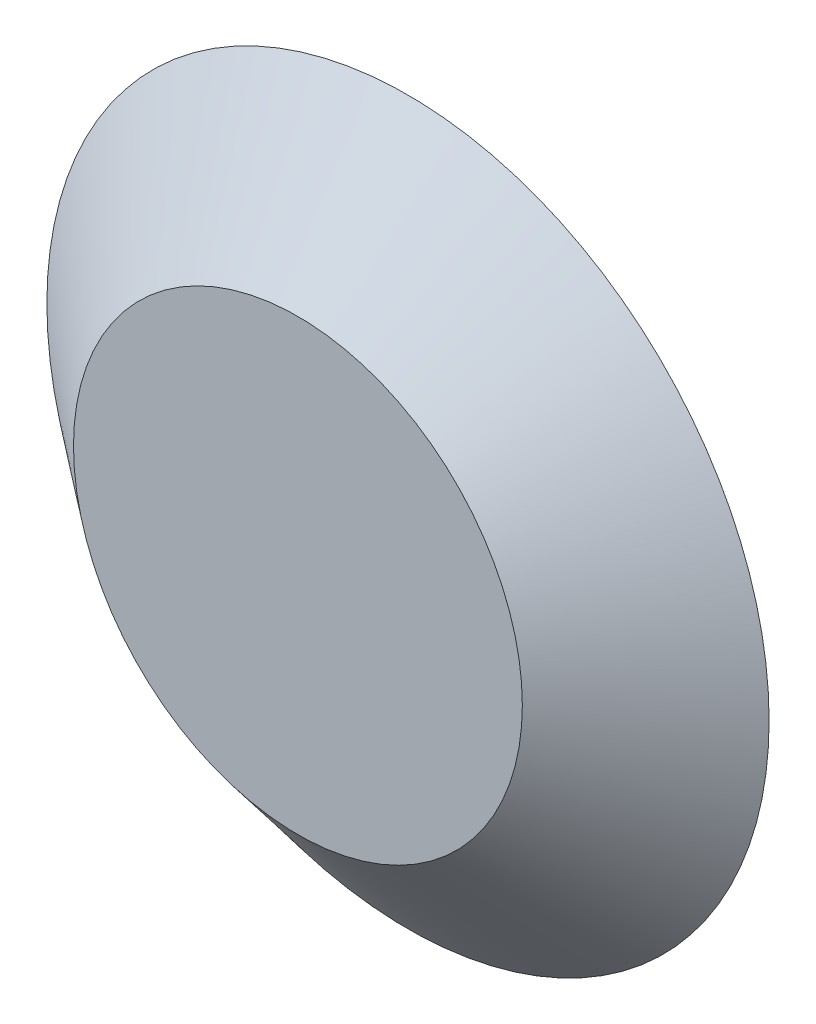
ISO-10303-21;
HEADER;
FILE_DESCRIPTION(('STEP AP214'),'2;1');
FILE_NAME('part.step','',(''),(''),'','','');
FILE_SCHEMA(('AUTOMOTIVE_DESIGN { 1 0 10303 214 1 1 1 1 }'));
ENDSEC;
DATA;
#1=APPLICATION_CONTEXT('core data for automotive mechanical design processes');
#2=APPLICATION_PROTOCOL_DEFINITION('international standard','automotive_design',2000,#1);
#3=PRODUCT_CONTEXT('',#1,'mechanical');
#4=PRODUCT('Part','Part','',(#3));
#5=PRODUCT_RELATED_PRODUCT_CATEGORY('part','',(#4));
#6=PRODUCT_DEFINITION_FORMATION('','',#4);
#7=PRODUCT_DEFINITION_CONTEXT('part definition',#1,'design');
#8=PRODUCT_DEFINITION('design','',#6,#7);
#9=PRODUCT_DEFINITION_SHAPE('','',#8);
#10=(LENGTH_UNIT() NAMED_UNIT(*) SI_UNIT(.MILLI.,.METRE.));
#11=(NAMED_UNIT(*) PLANE_ANGLE_UNIT() SI_UNIT($,.RADIAN.));
#12=(NAMED_UNIT(*) SI_UNIT($,.STERADIAN.) SOLID_ANGLE_UNIT());
#13=UNCERTAINTY_MEASURE_WITH_UNIT(LENGTH_MEASURE(1.E-05),#10,'distance_accuracy_value','');
#14=(GEOMETRIC_REPRESENTATION_CONTEXT(3) GLOBAL_UNCERTAINTY_ASSIGNED_CONTEXT((#13)) GLOBAL_UNIT_ASSIGNED_CONTEXT((#10,
#11,#12)) REPRESENTATION_CONTEXT('',''));
#15=CARTESIAN_POINT('',(0.,0.,0.));
#16=DIRECTION('',(0.,0.,1.));
#17=DIRECTION('',(1.,0.,0.));
#18=AXIS2_PLACEMENT_3D('',#15,#16,#17);
#19=CARTESIAN_POINT('',(0.,0.,0.));
#20=DIRECTION('',(0.,0.,-1.));
#21=DIRECTION('',(1.,0.,0.));
#22=AXIS2_PLACEMENT_3D('',#19,#20,#21);
#23=CONICAL_SURFACE('',#22,133.5,0.892735912395102);
#24=CARTESIAN_POINT('',(0.,0.,40.7));
#25=DIRECTION('',(0.,0.,1.));
#26=DIRECTION('',(1.,0.,0.));
#27=AXIS2_PLACEMENT_3D('',#24,#25,#26);
#28=CIRCLE('',#27,82.9697708958684);
#29=CARTESIAN_POINT('',(82.9697708958684,0.,40.7));
#30=VERTEX_POINT('',#29);
#31=EDGE_CURVE('E10',#30,#30,#28,.T.);
#32=ORIENTED_EDGE('',*,*,#31,.F.);
#33=EDGE_LOOP('',(#32));
#34=FACE_BOUND('',#33,.T.);
#35=CARTESIAN_POINT('',(0.,0.,0.));
#36=DIRECTION('',(0.,0.,1.));
#37=DIRECTION('',(1.,0.,0.));
#38=AXIS2_PLACEMENT_3D('',#35,#36,#37);
#39=CIRCLE('',#38,133.5);
#40=CARTESIAN_POINT('',(133.5,0.,0.));
#41=VERTEX_POINT('',#40);
#42=EDGE_CURVE('E38',#41,#41,#39,.T.);
#43=ORIENTED_EDGE('',*,*,#42,.T.);
#44=EDGE_LOOP('',(#43));
#45=FACE_BOUND('',#44,.T.);
#46=ADVANCED_FACE('F32',(#34,#45),#23,.T.);
#47=CARTESIAN_POINT('',(0.,0.,40.7));
#48=DIRECTION('',(0.,0.,1.));
#49=DIRECTION('',(1.,0.,0.));
#50=AXIS2_PLACEMENT_3D('',#47,#48,#49);
#51=PLANE('',#50);
#52=ORIENTED_EDGE('',*,*,#31,.T.);
#53=EDGE_LOOP('',(#52));
#54=FACE_BOUND('',#53,.T.);
#55=ADVANCED_FACE('F47',(#54),#51,.T.);
#56=CARTESIAN_POINT('',(0.,0.,0.));
#57=DIRECTION('',(0.,0.,1.));
#58=DIRECTION('',(1.,0.,0.));
#59=AXIS2_PLACEMENT_3D('',#56,#57,#58);
#60=PLANE('',#59);
#61=ORIENTED_EDGE('',*,*,#42,.F.);
#62=EDGE_LOOP('',(#61));
#63=FACE_BOUND('',#62,.T.);
#64=ADVANCED_FACE('F45',(#63),#60,.F.);
#65=CLOSED_SHELL('',(#46,#55,#64));
#66=MANIFOLD_SOLID_BREP('B2',#65);
#67=ADVANCED_BREP_SHAPE_REPRESENTATION('',(#18,#66),#14);
#68=SHAPE_DEFINITION_REPRESENTATION(#9,#67);
ENDSEC;
END-ISO-10303-21;
